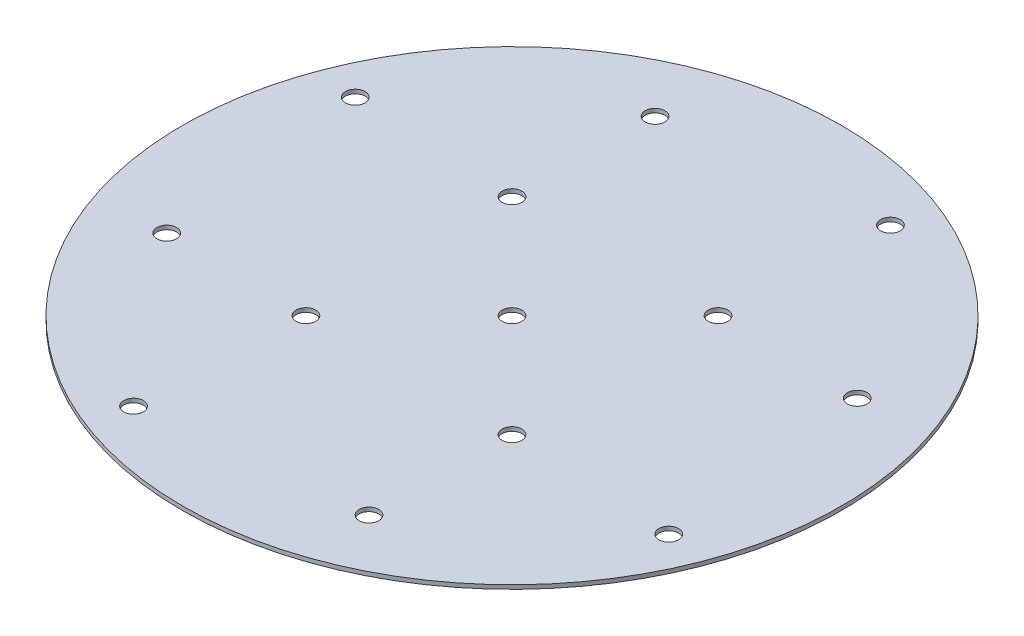
ISO-10303-21;
HEADER;
FILE_DESCRIPTION(('STEP AP214'),'2;1');
FILE_NAME('part.step','',(''),(''),'','','');
FILE_SCHEMA(('AUTOMOTIVE_DESIGN { 1 0 10303 214 1 1 1 1 }'));
ENDSEC;
DATA;
#1=APPLICATION_CONTEXT('core data for automotive mechanical design processes');
#2=APPLICATION_PROTOCOL_DEFINITION('international standard','automotive_design',2000,#1);
#3=PRODUCT_CONTEXT('',#1,'mechanical');
#4=PRODUCT('Part','Part','',(#3));
#5=PRODUCT_RELATED_PRODUCT_CATEGORY('part','',(#4));
#6=PRODUCT_DEFINITION_FORMATION('','',#4);
#7=PRODUCT_DEFINITION_CONTEXT('part definition',#1,'design');
#8=PRODUCT_DEFINITION('design','',#6,#7);
#9=PRODUCT_DEFINITION_SHAPE('','',#8);
#10=(LENGTH_UNIT() NAMED_UNIT(*) SI_UNIT(.MILLI.,.METRE.));
#11=(NAMED_UNIT(*) PLANE_ANGLE_UNIT() SI_UNIT($,.RADIAN.));
#12=(NAMED_UNIT(*) SI_UNIT($,.STERADIAN.) SOLID_ANGLE_UNIT());
#13=UNCERTAINTY_MEASURE_WITH_UNIT(LENGTH_MEASURE(1.E-05),#10,'distance_accuracy_value','');
#14=(GEOMETRIC_REPRESENTATION_CONTEXT(3) GLOBAL_UNCERTAINTY_ASSIGNED_CONTEXT((#13)) GLOBAL_UNIT_ASSIGNED_CONTEXT((#10,
#11,#12)) REPRESENTATION_CONTEXT('',''));
#15=CARTESIAN_POINT('',(0.,0.,0.));
#16=DIRECTION('',(0.,0.,1.));
#17=DIRECTION('',(1.,0.,0.));
#18=AXIS2_PLACEMENT_3D('',#15,#16,#17);
#19=CARTESIAN_POINT('',(0.,0.999999999999989,82.55));
#20=DIRECTION('',(0.,-1.,0.));
#21=DIRECTION('',(0.,0.,-1.));
#22=AXIS2_PLACEMENT_3D('',#19,#20,#21);
#23=PLANE('',#22);
#24=CARTESIAN_POINT('',(0.,0.999999999999989,0.));
#25=DIRECTION('',(0.,1.,0.));
#26=DIRECTION('',(0.,0.,1.));
#27=AXIS2_PLACEMENT_3D('',#24,#25,#26);
#28=CIRCLE('',#27,2.45745);
#29=CARTESIAN_POINT('',(0.,0.999999999999989,2.45745));
#30=VERTEX_POINT('',#29);
#31=EDGE_CURVE('E134',#30,#30,#28,.T.);
#32=ORIENTED_EDGE('',*,*,#31,.F.);
#33=EDGE_LOOP('',(#32));
#34=FACE_BOUND('',#33,.T.);
#35=CARTESIAN_POINT('',(27.7636830180864,0.999999999999989,-67.0274600836942));
#36=DIRECTION('',(0.,1.,0.));
#37=DIRECTION('',(0.,0.,1.));
#38=AXIS2_PLACEMENT_3D('',#35,#36,#37);
#39=CIRCLE('',#38,2.45745);
#40=CARTESIAN_POINT('',(27.7636830180864,0.999999999999989,-64.5700100836942));
#41=VERTEX_POINT('',#40);
#42=EDGE_CURVE('E122',#41,#41,#39,.T.);
#43=ORIENTED_EDGE('',*,*,#42,.F.);
#44=EDGE_LOOP('',(#43));
#45=FACE_BOUND('',#44,.T.);
#46=CARTESIAN_POINT('',(25.8093975133087,0.999999999999989,-25.8093975133093));
#47=DIRECTION('',(0.,1.,0.));
#48=DIRECTION('',(0.,0.,1.));
#49=AXIS2_PLACEMENT_3D('',#46,#47,#48);
#50=CIRCLE('',#49,2.45745);
#51=CARTESIAN_POINT('',(25.8093975133087,0.999999999999989,-23.3519475133093));
#52=VERTEX_POINT('',#51);
#53=EDGE_CURVE('E116',#52,#52,#50,.T.);
#54=ORIENTED_EDGE('',*,*,#53,.F.);
#55=EDGE_LOOP('',(#54));
#56=FACE_BOUND('',#55,.T.);
#57=CARTESIAN_POINT('',(25.333643222569,0.999999999999989,61.1608250522472));
#58=DIRECTION('',(0.,1.,0.));
#59=DIRECTION('',(0.,0.,1.));
#60=AXIS2_PLACEMENT_3D('',#57,#58,#59);
#61=CIRCLE('',#60,2.45745);
#62=CARTESIAN_POINT('',(25.333643222569,0.999999999999989,63.6182750522472));
#63=VERTEX_POINT('',#62);
#64=EDGE_CURVE('E110',#63,#63,#61,.T.);
#65=ORIENTED_EDGE('',*,*,#64,.F.);
#66=EDGE_LOOP('',(#65));
#67=FACE_BOUND('',#66,.T.);
#68=CARTESIAN_POINT('',(25.809397513309,0.999999999999989,25.8093975133089));
#69=DIRECTION('',(0.,1.,0.));
#70=DIRECTION('',(0.,0.,1.));
#71=AXIS2_PLACEMENT_3D('',#68,#69,#70);
#72=CIRCLE('',#71,2.45745);
#73=CARTESIAN_POINT('',(25.809397513309,0.999999999999989,28.2668475133089));
#74=VERTEX_POINT('',#73);
#75=EDGE_CURVE('E98',#74,#74,#72,.T.);
#76=ORIENTED_EDGE('',*,*,#75,.F.);
#77=EDGE_LOOP('',(#76));
#78=FACE_BOUND('',#77,.T.);
#79=CARTESIAN_POINT('',(-61.1608250522471,0.999999999999989,25.3336432225692));
#80=DIRECTION('',(0.,1.,0.));
#81=DIRECTION('',(0.,0.,1.));
#82=AXIS2_PLACEMENT_3D('',#79,#80,#81);
#83=CIRCLE('',#82,2.45745);
#84=CARTESIAN_POINT('',(-61.1608250522471,0.999999999999989,27.7910932225692));
#85=VERTEX_POINT('',#84);
#86=EDGE_CURVE('E92',#85,#85,#83,.T.);
#87=ORIENTED_EDGE('',*,*,#86,.F.);
#88=EDGE_LOOP('',(#87));
#89=FACE_BOUND('',#88,.T.);
#90=CARTESIAN_POINT('',(-27.7636830180869,0.999999999999989,67.027460083694));
#91=DIRECTION('',(0.,1.,0.));
#92=DIRECTION('',(0.,0.,1.));
#93=AXIS2_PLACEMENT_3D('',#90,#91,#92);
#94=CIRCLE('',#93,2.45745);
#95=CARTESIAN_POINT('',(-27.7636830180869,0.999999999999989,69.484910083694));
#96=VERTEX_POINT('',#95);
#97=EDGE_CURVE('E86',#96,#96,#94,.T.);
#98=ORIENTED_EDGE('',*,*,#97,.F.);
#99=EDGE_LOOP('',(#98));
#100=FACE_BOUND('',#99,.T.);
#101=CARTESIAN_POINT('',(-25.8093975133088,0.999999999999989,25.8093975133091));
#102=DIRECTION('',(0.,1.,0.));
#103=DIRECTION('',(0.,0.,1.));
#104=AXIS2_PLACEMENT_3D('',#101,#102,#103);
#105=CIRCLE('',#104,2.45745);
#106=CARTESIAN_POINT('',(-25.8093975133088,0.999999999999989,28.2668475133091));
#107=VERTEX_POINT('',#106);
#108=EDGE_CURVE('E80',#107,#107,#105,.T.);
#109=ORIENTED_EDGE('',*,*,#108,.F.);
#110=EDGE_LOOP('',(#109));
#111=FACE_BOUND('',#110,.T.);
#112=CARTESIAN_POINT('',(-25.333643222569,0.999999999999989,-61.1608250522472));
#113=DIRECTION('',(0.,1.,0.));
#114=DIRECTION('',(0.,0.,1.));
#115=AXIS2_PLACEMENT_3D('',#112,#113,#114);
#116=CIRCLE('',#115,2.45745);
#117=CARTESIAN_POINT('',(-25.333643222569,0.999999999999989,-58.7033750522472));
#118=VERTEX_POINT('',#117);
#119=EDGE_CURVE('E74',#118,#118,#116,.T.);
#120=ORIENTED_EDGE('',*,*,#119,.F.);
#121=EDGE_LOOP('',(#120));
#122=FACE_BOUND('',#121,.T.);
#123=CARTESIAN_POINT('',(-67.0274600836939,0.999999999999989,-27.7636830180871));
#124=DIRECTION('',(0.,1.,0.));
#125=DIRECTION('',(0.,0.,1.));
#126=AXIS2_PLACEMENT_3D('',#123,#124,#125);
#127=CIRCLE('',#126,2.45745);
#128=CARTESIAN_POINT('',(-67.0274600836939,0.999999999999989,-25.3062330180871));
#129=VERTEX_POINT('',#128);
#130=EDGE_CURVE('E68',#129,#129,#127,.T.);
#131=ORIENTED_EDGE('',*,*,#130,.F.);
#132=EDGE_LOOP('',(#131));
#133=FACE_BOUND('',#132,.T.);
#134=CARTESIAN_POINT('',(-25.809397513309,0.999999999999989,-25.8093975133089));
#135=DIRECTION('',(0.,1.,0.));
#136=DIRECTION('',(0.,0.,1.));
#137=AXIS2_PLACEMENT_3D('',#134,#135,#136);
#138=CIRCLE('',#137,2.45745);
#139=CARTESIAN_POINT('',(-25.809397513309,0.999999999999989,-23.3519475133089));
#140=VERTEX_POINT('',#139);
#141=EDGE_CURVE('E60',#140,#140,#138,.T.);
#142=ORIENTED_EDGE('',*,*,#141,.F.);
#143=EDGE_LOOP('',(#142));
#144=FACE_BOUND('',#143,.T.);
#145=CARTESIAN_POINT('',(0.,0.99999999999999,0.));
#146=DIRECTION('',(0.,-1.,0.));
#147=DIRECTION('',(0.,0.,-1.));
#148=AXIS2_PLACEMENT_3D('',#145,#146,#147);
#149=CIRCLE('',#148,82.55);
#150=CARTESIAN_POINT('',(0.,0.99999999999999,-82.55));
#151=VERTEX_POINT('',#150);
#152=EDGE_CURVE('E52',#151,#151,#149,.T.);
#153=ORIENTED_EDGE('',*,*,#152,.F.);
#154=EDGE_LOOP('',(#153));
#155=FACE_BOUND('',#154,.T.);
#156=CARTESIAN_POINT('',(67.0274600836939,0.999999999999989,27.7636830180871));
#157=DIRECTION('',(0.,1.,0.));
#158=DIRECTION('',(0.,0.,1.));
#159=AXIS2_PLACEMENT_3D('',#156,#157,#158);
#160=CIRCLE('',#159,2.45745);
#161=CARTESIAN_POINT('',(67.0274600836939,0.999999999999989,30.2211330180871));
#162=VERTEX_POINT('',#161);
#163=EDGE_CURVE('E104',#162,#162,#160,.T.);
#164=ORIENTED_EDGE('',*,*,#163,.F.);
#165=EDGE_LOOP('',(#164));
#166=FACE_BOUND('',#165,.T.);
#167=CARTESIAN_POINT('',(61.1608250522469,0.999999999999989,-25.3336432225696));
#168=DIRECTION('',(0.,1.,0.));
#169=DIRECTION('',(0.,0.,1.));
#170=AXIS2_PLACEMENT_3D('',#167,#168,#169);
#171=CIRCLE('',#170,2.45744999999999);
#172=CARTESIAN_POINT('',(61.1608250522469,0.999999999999989,-22.8761932225696));
#173=VERTEX_POINT('',#172);
#174=EDGE_CURVE('E128',#173,#173,#171,.T.);
#175=ORIENTED_EDGE('',*,*,#174,.F.);
#176=EDGE_LOOP('',(#175));
#177=FACE_BOUND('',#176,.T.);
#178=ADVANCED_FACE('F45',(#34,#45,#56,#67,#78,#89,#100,#111,#122,#133,#144,#155,#166,#177),#23,.F.);
#179=CARTESIAN_POINT('',(0.,0.,0.));
#180=DIRECTION('',(0.,1.,0.));
#181=DIRECTION('',(0.,0.,1.));
#182=AXIS2_PLACEMENT_3D('',#179,#180,#181);
#183=PLANE('',#182);
#184=CARTESIAN_POINT('',(0.,0.,0.));
#185=DIRECTION('',(0.,1.,0.));
#186=DIRECTION('',(0.,0.,1.));
#187=AXIS2_PLACEMENT_3D('',#184,#185,#186);
#188=CIRCLE('',#187,2.45745);
#189=CARTESIAN_POINT('',(0.,0.,2.45745));
#190=VERTEX_POINT('',#189);
#191=EDGE_CURVE('E131',#190,#190,#188,.T.);
#192=ORIENTED_EDGE('',*,*,#191,.T.);
#193=EDGE_LOOP('',(#192));
#194=FACE_BOUND('',#193,.T.);
#195=CARTESIAN_POINT('',(61.1608250522469,0.,-25.3336432225696));
#196=DIRECTION('',(0.,1.,0.));
#197=DIRECTION('',(0.,0.,1.));
#198=AXIS2_PLACEMENT_3D('',#195,#196,#197);
#199=CIRCLE('',#198,2.45744999999999);
#200=CARTESIAN_POINT('',(61.1608250522469,0.,-22.8761932225696));
#201=VERTEX_POINT('',#200);
#202=EDGE_CURVE('E125',#201,#201,#199,.T.);
#203=ORIENTED_EDGE('',*,*,#202,.T.);
#204=EDGE_LOOP('',(#203));
#205=FACE_BOUND('',#204,.T.);
#206=CARTESIAN_POINT('',(27.7636830180864,0.,-67.0274600836942));
#207=DIRECTION('',(0.,1.,0.));
#208=DIRECTION('',(0.,0.,1.));
#209=AXIS2_PLACEMENT_3D('',#206,#207,#208);
#210=CIRCLE('',#209,2.45745);
#211=CARTESIAN_POINT('',(27.7636830180864,0.,-64.5700100836942));
#212=VERTEX_POINT('',#211);
#213=EDGE_CURVE('E119',#212,#212,#210,.T.);
#214=ORIENTED_EDGE('',*,*,#213,.T.);
#215=EDGE_LOOP('',(#214));
#216=FACE_BOUND('',#215,.T.);
#217=CARTESIAN_POINT('',(25.8093975133087,0.,-25.8093975133093));
#218=DIRECTION('',(0.,1.,0.));
#219=DIRECTION('',(0.,0.,1.));
#220=AXIS2_PLACEMENT_3D('',#217,#218,#219);
#221=CIRCLE('',#220,2.45745);
#222=CARTESIAN_POINT('',(25.8093975133087,0.,-23.3519475133093));
#223=VERTEX_POINT('',#222);
#224=EDGE_CURVE('E113',#223,#223,#221,.T.);
#225=ORIENTED_EDGE('',*,*,#224,.T.);
#226=EDGE_LOOP('',(#225));
#227=FACE_BOUND('',#226,.T.);
#228=CARTESIAN_POINT('',(25.333643222569,0.,61.1608250522472));
#229=DIRECTION('',(0.,1.,0.));
#230=DIRECTION('',(0.,0.,1.));
#231=AXIS2_PLACEMENT_3D('',#228,#229,#230);
#232=CIRCLE('',#231,2.45745);
#233=CARTESIAN_POINT('',(25.333643222569,0.,63.6182750522472));
#234=VERTEX_POINT('',#233);
#235=EDGE_CURVE('E107',#234,#234,#232,.T.);
#236=ORIENTED_EDGE('',*,*,#235,.T.);
#237=EDGE_LOOP('',(#236));
#238=FACE_BOUND('',#237,.T.);
#239=CARTESIAN_POINT('',(67.0274600836939,0.,27.7636830180871));
#240=DIRECTION('',(0.,1.,0.));
#241=DIRECTION('',(0.,0.,1.));
#242=AXIS2_PLACEMENT_3D('',#239,#240,#241);
#243=CIRCLE('',#242,2.45745);
#244=CARTESIAN_POINT('',(67.0274600836939,0.,30.2211330180871));
#245=VERTEX_POINT('',#244);
#246=EDGE_CURVE('E101',#245,#245,#243,.T.);
#247=ORIENTED_EDGE('',*,*,#246,.T.);
#248=EDGE_LOOP('',(#247));
#249=FACE_BOUND('',#248,.T.);
#250=CARTESIAN_POINT('',(25.809397513309,0.,25.8093975133089));
#251=DIRECTION('',(0.,1.,0.));
#252=DIRECTION('',(0.,0.,1.));
#253=AXIS2_PLACEMENT_3D('',#250,#251,#252);
#254=CIRCLE('',#253,2.45745);
#255=CARTESIAN_POINT('',(25.809397513309,0.,28.2668475133089));
#256=VERTEX_POINT('',#255);
#257=EDGE_CURVE('E95',#256,#256,#254,.T.);
#258=ORIENTED_EDGE('',*,*,#257,.T.);
#259=EDGE_LOOP('',(#258));
#260=FACE_BOUND('',#259,.T.);
#261=CARTESIAN_POINT('',(-61.1608250522471,0.,25.3336432225692));
#262=DIRECTION('',(0.,1.,0.));
#263=DIRECTION('',(0.,0.,1.));
#264=AXIS2_PLACEMENT_3D('',#261,#262,#263);
#265=CIRCLE('',#264,2.45745);
#266=CARTESIAN_POINT('',(-61.1608250522471,0.,27.7910932225692));
#267=VERTEX_POINT('',#266);
#268=EDGE_CURVE('E89',#267,#267,#265,.T.);
#269=ORIENTED_EDGE('',*,*,#268,.T.);
#270=EDGE_LOOP('',(#269));
#271=FACE_BOUND('',#270,.T.);
#272=CARTESIAN_POINT('',(-27.7636830180869,0.,67.027460083694));
#273=DIRECTION('',(0.,1.,0.));
#274=DIRECTION('',(0.,0.,1.));
#275=AXIS2_PLACEMENT_3D('',#272,#273,#274);
#276=CIRCLE('',#275,2.45745);
#277=CARTESIAN_POINT('',(-27.7636830180869,0.,69.484910083694));
#278=VERTEX_POINT('',#277);
#279=EDGE_CURVE('E83',#278,#278,#276,.T.);
#280=ORIENTED_EDGE('',*,*,#279,.T.);
#281=EDGE_LOOP('',(#280));
#282=FACE_BOUND('',#281,.T.);
#283=CARTESIAN_POINT('',(-25.8093975133088,0.,25.8093975133091));
#284=DIRECTION('',(0.,1.,0.));
#285=DIRECTION('',(0.,0.,1.));
#286=AXIS2_PLACEMENT_3D('',#283,#284,#285);
#287=CIRCLE('',#286,2.45745);
#288=CARTESIAN_POINT('',(-25.8093975133088,0.,28.2668475133091));
#289=VERTEX_POINT('',#288);
#290=EDGE_CURVE('E77',#289,#289,#287,.T.);
#291=ORIENTED_EDGE('',*,*,#290,.T.);
#292=EDGE_LOOP('',(#291));
#293=FACE_BOUND('',#292,.T.);
#294=CARTESIAN_POINT('',(-25.333643222569,0.,-61.1608250522472));
#295=DIRECTION('',(0.,1.,0.));
#296=DIRECTION('',(0.,0.,1.));
#297=AXIS2_PLACEMENT_3D('',#294,#295,#296);
#298=CIRCLE('',#297,2.45745);
#299=CARTESIAN_POINT('',(-25.333643222569,0.,-58.7033750522472));
#300=VERTEX_POINT('',#299);
#301=EDGE_CURVE('E71',#300,#300,#298,.T.);
#302=ORIENTED_EDGE('',*,*,#301,.T.);
#303=EDGE_LOOP('',(#302));
#304=FACE_BOUND('',#303,.T.);
#305=CARTESIAN_POINT('',(-67.0274600836939,0.,-27.7636830180871));
#306=DIRECTION('',(0.,1.,0.));
#307=DIRECTION('',(0.,0.,1.));
#308=AXIS2_PLACEMENT_3D('',#305,#306,#307);
#309=CIRCLE('',#308,2.45745);
#310=CARTESIAN_POINT('',(-67.0274600836939,0.,-25.3062330180871));
#311=VERTEX_POINT('',#310);
#312=EDGE_CURVE('E65',#311,#311,#309,.T.);
#313=ORIENTED_EDGE('',*,*,#312,.T.);
#314=EDGE_LOOP('',(#313));
#315=FACE_BOUND('',#314,.T.);
#316=CARTESIAN_POINT('',(-25.809397513309,0.,-25.8093975133089));
#317=DIRECTION('',(0.,1.,0.));
#318=DIRECTION('',(0.,0.,1.));
#319=AXIS2_PLACEMENT_3D('',#316,#317,#318);
#320=CIRCLE('',#319,2.45745);
#321=CARTESIAN_POINT('',(-25.809397513309,0.,-23.3519475133089));
#322=VERTEX_POINT('',#321);
#323=EDGE_CURVE('E56',#322,#322,#320,.T.);
#324=ORIENTED_EDGE('',*,*,#323,.T.);
#325=EDGE_LOOP('',(#324));
#326=FACE_BOUND('',#325,.T.);
#327=CARTESIAN_POINT('',(0.,0.,0.));
#328=DIRECTION('',(0.,-1.,0.));
#329=DIRECTION('',(0.,0.,-1.));
#330=AXIS2_PLACEMENT_3D('',#327,#328,#329);
#331=CIRCLE('',#330,82.55);
#332=CARTESIAN_POINT('',(0.,0.,-82.55));
#333=VERTEX_POINT('',#332);
#334=EDGE_CURVE('E12',#333,#333,#331,.T.);
#335=ORIENTED_EDGE('',*,*,#334,.T.);
#336=EDGE_LOOP('',(#335));
#337=FACE_BOUND('',#336,.T.);
#338=ADVANCED_FACE('F47',(#194,#205,#216,#227,#238,#249,#260,#271,#282,#293,#304,#315,#326,
#337),#183,.F.);
#339=CARTESIAN_POINT('',(0.,-0.0500000000000102,0.));
#340=DIRECTION('',(0.,-1.,0.));
#341=DIRECTION('',(0.,0.,-1.));
#342=AXIS2_PLACEMENT_3D('',#339,#340,#341);
#343=CYLINDRICAL_SURFACE('',#342,82.55);
#344=ORIENTED_EDGE('',*,*,#334,.F.);
#345=EDGE_LOOP('',(#344));
#346=FACE_BOUND('',#345,.T.);
#347=ORIENTED_EDGE('',*,*,#152,.T.);
#348=EDGE_LOOP('',(#347));
#349=FACE_BOUND('',#348,.T.);
#350=ADVANCED_FACE('F221',(#346,#349),#343,.T.);
#351=CARTESIAN_POINT('',(-25.809397513309,0.999999999999989,-25.8093975133089));
#352=DIRECTION('',(0.,1.,0.));
#353=DIRECTION('',(0.,0.,1.));
#354=AXIS2_PLACEMENT_3D('',#351,#352,#353);
#355=CYLINDRICAL_SURFACE('',#354,2.45745);
#356=ORIENTED_EDGE('',*,*,#323,.F.);
#357=EDGE_LOOP('',(#356));
#358=FACE_BOUND('',#357,.T.);
#359=ORIENTED_EDGE('',*,*,#141,.T.);
#360=EDGE_LOOP('',(#359));
#361=FACE_BOUND('',#360,.T.);
#362=ADVANCED_FACE('F218',(#358,#361),#355,.F.);
#363=CARTESIAN_POINT('',(-67.0274600836939,0.999999999999989,-27.7636830180871));
#364=DIRECTION('',(0.,1.,0.));
#365=DIRECTION('',(0.,0.,1.));
#366=AXIS2_PLACEMENT_3D('',#363,#364,#365);
#367=CYLINDRICAL_SURFACE('',#366,2.45745);
#368=ORIENTED_EDGE('',*,*,#312,.F.);
#369=EDGE_LOOP('',(#368));
#370=FACE_BOUND('',#369,.T.);
#371=ORIENTED_EDGE('',*,*,#130,.T.);
#372=EDGE_LOOP('',(#371));
#373=FACE_BOUND('',#372,.T.);
#374=ADVANCED_FACE('F214',(#370,#373),#367,.F.);
#375=CARTESIAN_POINT('',(-25.333643222569,0.999999999999989,-61.1608250522472));
#376=DIRECTION('',(0.,1.,0.));
#377=DIRECTION('',(0.,0.,1.));
#378=AXIS2_PLACEMENT_3D('',#375,#376,#377);
#379=CYLINDRICAL_SURFACE('',#378,2.45745);
#380=ORIENTED_EDGE('',*,*,#301,.F.);
#381=EDGE_LOOP('',(#380));
#382=FACE_BOUND('',#381,.T.);
#383=ORIENTED_EDGE('',*,*,#119,.T.);
#384=EDGE_LOOP('',(#383));
#385=FACE_BOUND('',#384,.T.);
#386=ADVANCED_FACE('F210',(#382,#385),#379,.F.);
#387=CARTESIAN_POINT('',(-25.8093975133088,0.999999999999989,25.8093975133091));
#388=DIRECTION('',(0.,1.,0.));
#389=DIRECTION('',(0.,0.,1.));
#390=AXIS2_PLACEMENT_3D('',#387,#388,#389);
#391=CYLINDRICAL_SURFACE('',#390,2.45745);
#392=ORIENTED_EDGE('',*,*,#290,.F.);
#393=EDGE_LOOP('',(#392));
#394=FACE_BOUND('',#393,.T.);
#395=ORIENTED_EDGE('',*,*,#108,.T.);
#396=EDGE_LOOP('',(#395));
#397=FACE_BOUND('',#396,.T.);
#398=ADVANCED_FACE('F206',(#394,#397),#391,.F.);
#399=CARTESIAN_POINT('',(-27.7636830180869,0.999999999999989,67.027460083694));
#400=DIRECTION('',(0.,1.,0.));
#401=DIRECTION('',(0.,0.,1.));
#402=AXIS2_PLACEMENT_3D('',#399,#400,#401);
#403=CYLINDRICAL_SURFACE('',#402,2.45745);
#404=ORIENTED_EDGE('',*,*,#279,.F.);
#405=EDGE_LOOP('',(#404));
#406=FACE_BOUND('',#405,.T.);
#407=ORIENTED_EDGE('',*,*,#97,.T.);
#408=EDGE_LOOP('',(#407));
#409=FACE_BOUND('',#408,.T.);
#410=ADVANCED_FACE('F202',(#406,#409),#403,.F.);
#411=CARTESIAN_POINT('',(-61.1608250522471,0.999999999999989,25.3336432225692));
#412=DIRECTION('',(0.,1.,0.));
#413=DIRECTION('',(0.,0.,1.));
#414=AXIS2_PLACEMENT_3D('',#411,#412,#413);
#415=CYLINDRICAL_SURFACE('',#414,2.45745);
#416=ORIENTED_EDGE('',*,*,#268,.F.);
#417=EDGE_LOOP('',(#416));
#418=FACE_BOUND('',#417,.T.);
#419=ORIENTED_EDGE('',*,*,#86,.T.);
#420=EDGE_LOOP('',(#419));
#421=FACE_BOUND('',#420,.T.);
#422=ADVANCED_FACE('F198',(#418,#421),#415,.F.);
#423=CARTESIAN_POINT('',(25.809397513309,0.999999999999989,25.8093975133089));
#424=DIRECTION('',(0.,1.,0.));
#425=DIRECTION('',(0.,0.,1.));
#426=AXIS2_PLACEMENT_3D('',#423,#424,#425);
#427=CYLINDRICAL_SURFACE('',#426,2.45745);
#428=ORIENTED_EDGE('',*,*,#257,.F.);
#429=EDGE_LOOP('',(#428));
#430=FACE_BOUND('',#429,.T.);
#431=ORIENTED_EDGE('',*,*,#75,.T.);
#432=EDGE_LOOP('',(#431));
#433=FACE_BOUND('',#432,.T.);
#434=ADVANCED_FACE('F194',(#430,#433),#427,.F.);
#435=CARTESIAN_POINT('',(67.0274600836939,0.999999999999989,27.7636830180871));
#436=DIRECTION('',(0.,1.,0.));
#437=DIRECTION('',(0.,0.,1.));
#438=AXIS2_PLACEMENT_3D('',#435,#436,#437);
#439=CYLINDRICAL_SURFACE('',#438,2.45745);
#440=ORIENTED_EDGE('',*,*,#246,.F.);
#441=EDGE_LOOP('',(#440));
#442=FACE_BOUND('',#441,.T.);
#443=ORIENTED_EDGE('',*,*,#163,.T.);
#444=EDGE_LOOP('',(#443));
#445=FACE_BOUND('',#444,.T.);
#446=ADVANCED_FACE('F190',(#442,#445),#439,.F.);
#447=CARTESIAN_POINT('',(25.333643222569,0.999999999999989,61.1608250522472));
#448=DIRECTION('',(0.,1.,0.));
#449=DIRECTION('',(0.,0.,1.));
#450=AXIS2_PLACEMENT_3D('',#447,#448,#449);
#451=CYLINDRICAL_SURFACE('',#450,2.45745);
#452=ORIENTED_EDGE('',*,*,#235,.F.);
#453=EDGE_LOOP('',(#452));
#454=FACE_BOUND('',#453,.T.);
#455=ORIENTED_EDGE('',*,*,#64,.T.);
#456=EDGE_LOOP('',(#455));
#457=FACE_BOUND('',#456,.T.);
#458=ADVANCED_FACE('F186',(#454,#457),#451,.F.);
#459=CARTESIAN_POINT('',(25.8093975133087,0.999999999999989,-25.8093975133093));
#460=DIRECTION('',(0.,1.,0.));
#461=DIRECTION('',(0.,0.,1.));
#462=AXIS2_PLACEMENT_3D('',#459,#460,#461);
#463=CYLINDRICAL_SURFACE('',#462,2.45745);
#464=ORIENTED_EDGE('',*,*,#224,.F.);
#465=EDGE_LOOP('',(#464));
#466=FACE_BOUND('',#465,.T.);
#467=ORIENTED_EDGE('',*,*,#53,.T.);
#468=EDGE_LOOP('',(#467));
#469=FACE_BOUND('',#468,.T.);
#470=ADVANCED_FACE('F179',(#466,#469),#463,.F.);
#471=CARTESIAN_POINT('',(27.7636830180864,0.999999999999989,-67.0274600836942));
#472=DIRECTION('',(0.,1.,0.));
#473=DIRECTION('',(0.,0.,1.));
#474=AXIS2_PLACEMENT_3D('',#471,#472,#473);
#475=CYLINDRICAL_SURFACE('',#474,2.45745);
#476=ORIENTED_EDGE('',*,*,#213,.F.);
#477=EDGE_LOOP('',(#476));
#478=FACE_BOUND('',#477,.T.);
#479=ORIENTED_EDGE('',*,*,#42,.T.);
#480=EDGE_LOOP('',(#479));
#481=FACE_BOUND('',#480,.T.);
#482=ADVANCED_FACE('F170',(#478,#481),#475,.F.);
#483=CARTESIAN_POINT('',(61.1608250522469,0.999999999999989,-25.3336432225696));
#484=DIRECTION('',(0.,1.,0.));
#485=DIRECTION('',(0.,0.,1.));
#486=AXIS2_PLACEMENT_3D('',#483,#484,#485);
#487=CYLINDRICAL_SURFACE('',#486,2.45744999999999);
#488=ORIENTED_EDGE('',*,*,#202,.F.);
#489=EDGE_LOOP('',(#488));
#490=FACE_BOUND('',#489,.T.);
#491=ORIENTED_EDGE('',*,*,#174,.T.);
#492=EDGE_LOOP('',(#491));
#493=FACE_BOUND('',#492,.T.);
#494=ADVANCED_FACE('F168',(#490,#493),#487,.F.);
#495=CARTESIAN_POINT('',(0.,0.999999999999989,0.));
#496=DIRECTION('',(0.,1.,0.));
#497=DIRECTION('',(0.,0.,1.));
#498=AXIS2_PLACEMENT_3D('',#495,#496,#497);
#499=CYLINDRICAL_SURFACE('',#498,2.45745);
#500=ORIENTED_EDGE('',*,*,#191,.F.);
#501=EDGE_LOOP('',(#500));
#502=FACE_BOUND('',#501,.T.);
#503=ORIENTED_EDGE('',*,*,#31,.T.);
#504=EDGE_LOOP('',(#503));
#505=FACE_BOUND('',#504,.T.);
#506=ADVANCED_FACE('F138',(#502,#505),#499,.F.);
#507=CLOSED_SHELL('',(#178,#338,#350,#362,#374,#386,#398,#410,#422,#434,#446,#458,#470,#482,
#494,#506));
#508=MANIFOLD_SOLID_BREP('B2',#507);
#509=ADVANCED_BREP_SHAPE_REPRESENTATION('',(#18,#508),#14);
#510=SHAPE_DEFINITION_REPRESENTATION(#9,#509);
ENDSEC;
END-ISO-10303-21;
